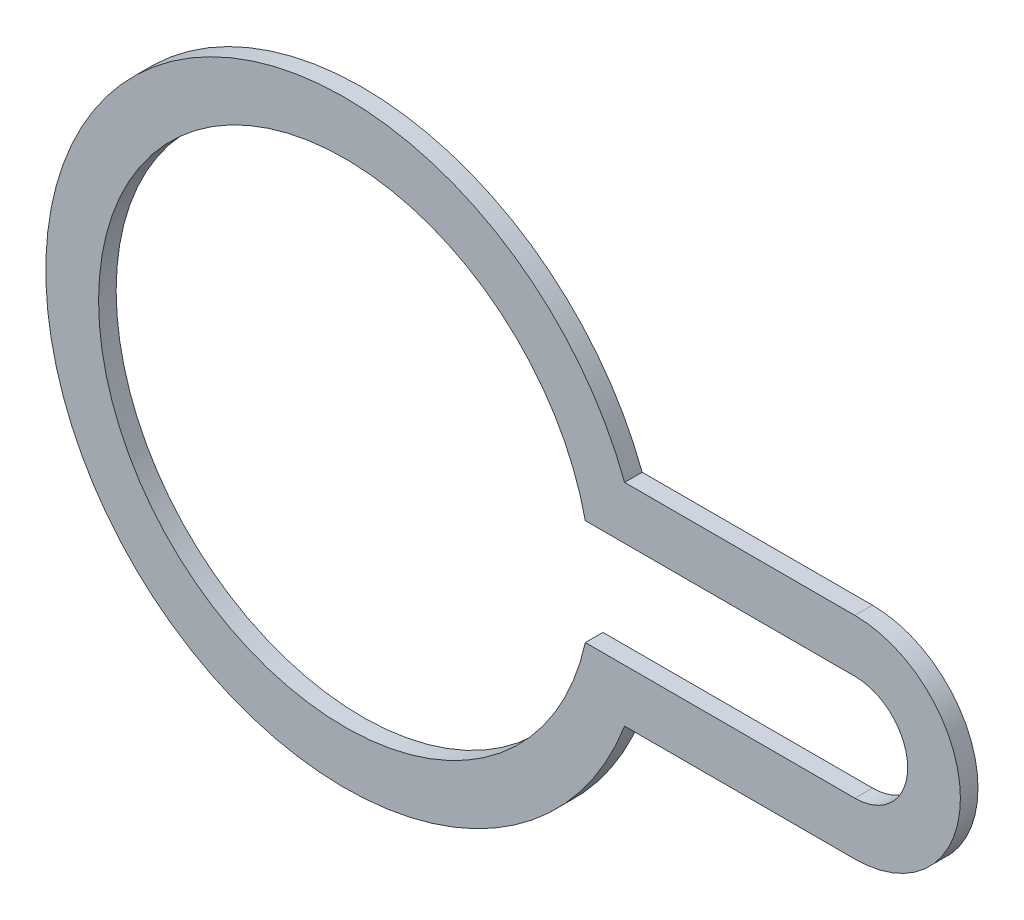
ISO-10303-21;
HEADER;
FILE_DESCRIPTION(('STEP AP214'),'2;1');
FILE_NAME('part.step','',(''),(''),'','','');
FILE_SCHEMA(('AUTOMOTIVE_DESIGN { 1 0 10303 214 1 1 1 1 }'));
ENDSEC;
DATA;
#1=APPLICATION_CONTEXT('core data for automotive mechanical design processes');
#2=APPLICATION_PROTOCOL_DEFINITION('international standard','automotive_design',2000,#1);
#3=PRODUCT_CONTEXT('',#1,'mechanical');
#4=PRODUCT('Part','Part','',(#3));
#5=PRODUCT_RELATED_PRODUCT_CATEGORY('part','',(#4));
#6=PRODUCT_DEFINITION_FORMATION('','',#4);
#7=PRODUCT_DEFINITION_CONTEXT('part definition',#1,'design');
#8=PRODUCT_DEFINITION('design','',#6,#7);
#9=PRODUCT_DEFINITION_SHAPE('','',#8);
#10=(LENGTH_UNIT() NAMED_UNIT(*) SI_UNIT(.MILLI.,.METRE.));
#11=(NAMED_UNIT(*) PLANE_ANGLE_UNIT() SI_UNIT($,.RADIAN.));
#12=(NAMED_UNIT(*) SI_UNIT($,.STERADIAN.) SOLID_ANGLE_UNIT());
#13=UNCERTAINTY_MEASURE_WITH_UNIT(LENGTH_MEASURE(1.E-05),#10,'distance_accuracy_value','');
#14=(GEOMETRIC_REPRESENTATION_CONTEXT(3) GLOBAL_UNCERTAINTY_ASSIGNED_CONTEXT((#13)) GLOBAL_UNIT_ASSIGNED_CONTEXT((#10,
#11,#12)) REPRESENTATION_CONTEXT('',''));
#15=CARTESIAN_POINT('',(0.,0.,0.));
#16=DIRECTION('',(0.,0.,1.));
#17=DIRECTION('',(1.,0.,0.));
#18=AXIS2_PLACEMENT_3D('',#15,#16,#17);
#19=CARTESIAN_POINT('',(0.,0.,1.));
#20=DIRECTION('',(0.,0.,-1.));
#21=DIRECTION('',(-1.,0.,0.));
#22=AXIS2_PLACEMENT_3D('',#19,#20,#21);
#23=PLANE('',#22);
#24=DIRECTION('',(-1.,0.,0.));
#25=VECTOR('',#24,1.);
#26=CARTESIAN_POINT('',(29.,-6.,1.));
#27=LINE('',#26,#25);
#28=CARTESIAN_POINT('',(29.,-6.,1.));
#29=VERTEX_POINT('',#28);
#30=CARTESIAN_POINT('',(15.9059737205869,-6.,1.));
#31=VERTEX_POINT('',#30);
#32=EDGE_CURVE('E177',#29,#31,#27,.T.);
#33=ORIENTED_EDGE('',*,*,#32,.F.);
#34=CARTESIAN_POINT('',(29.,0.,1.));
#35=DIRECTION('',(0.,0.,-1.));
#36=DIRECTION('',(-1.,0.,0.));
#37=AXIS2_PLACEMENT_3D('',#34,#35,#36);
#38=CIRCLE('',#37,6.);
#39=CARTESIAN_POINT('',(29.,6.,1.));
#40=VERTEX_POINT('',#39);
#41=EDGE_CURVE('E189',#40,#29,#38,.T.);
#42=ORIENTED_EDGE('',*,*,#41,.F.);
#43=DIRECTION('',(-1.,0.,0.));
#44=VECTOR('',#43,1.);
#45=CARTESIAN_POINT('',(29.,6.,1.));
#46=LINE('',#45,#44);
#47=CARTESIAN_POINT('',(15.9059737205869,6.,1.));
#48=VERTEX_POINT('',#47);
#49=EDGE_CURVE('E186',#40,#48,#46,.T.);
#50=ORIENTED_EDGE('',*,*,#49,.T.);
#51=CARTESIAN_POINT('',(0.,0.,1.));
#52=DIRECTION('',(0.,0.,-1.));
#53=DIRECTION('',(-1.,0.,0.));
#54=AXIS2_PLACEMENT_3D('',#51,#52,#53);
#55=CIRCLE('',#54,17.);
#56=EDGE_CURVE('E181',#31,#48,#55,.T.);
#57=ORIENTED_EDGE('',*,*,#56,.F.);
#58=EDGE_LOOP('',(#33,#42,#50,#57));
#59=FACE_BOUND('',#58,.T.);
#60=DIRECTION('',(1.,0.,0.));
#61=VECTOR('',#60,1.);
#62=CARTESIAN_POINT('',(13.6747943311773,-3.,1.));
#63=LINE('',#62,#61);
#64=CARTESIAN_POINT('',(13.6747943311773,-2.99999999999999,1.));
#65=VERTEX_POINT('',#64);
#66=CARTESIAN_POINT('',(29.,-3.,1.));
#67=VERTEX_POINT('',#66);
#68=EDGE_CURVE('E128',#65,#67,#63,.T.);
#69=ORIENTED_EDGE('',*,*,#68,.F.);
#70=CARTESIAN_POINT('',(0.,0.,1.));
#71=DIRECTION('',(0.,0.,-1.));
#72=DIRECTION('',(-1.,0.,0.));
#73=AXIS2_PLACEMENT_3D('',#70,#71,#72);
#74=CIRCLE('',#73,14.);
#75=CARTESIAN_POINT('',(13.6747943311773,2.99999999999999,1.));
#76=VERTEX_POINT('',#75);
#77=EDGE_CURVE('E154',#65,#76,#74,.T.);
#78=ORIENTED_EDGE('',*,*,#77,.T.);
#79=DIRECTION('',(1.,0.,0.));
#80=VECTOR('',#79,1.);
#81=CARTESIAN_POINT('',(13.6747943311773,3.,1.));
#82=LINE('',#81,#80);
#83=CARTESIAN_POINT('',(29.,3.,1.));
#84=VERTEX_POINT('',#83);
#85=EDGE_CURVE('E81',#76,#84,#82,.T.);
#86=ORIENTED_EDGE('',*,*,#85,.T.);
#87=CARTESIAN_POINT('',(29.,0.,1.));
#88=DIRECTION('',(0.,0.,-1.));
#89=DIRECTION('',(-1.,0.,0.));
#90=AXIS2_PLACEMENT_3D('',#87,#88,#89);
#91=CIRCLE('',#90,3.);
#92=EDGE_CURVE('E139',#84,#67,#91,.T.);
#93=ORIENTED_EDGE('',*,*,#92,.T.);
#94=EDGE_LOOP('',(#69,#78,#86,#93));
#95=FACE_BOUND('',#94,.T.);
#96=ADVANCED_FACE('F63',(#59,#95),#23,.F.);
#97=CARTESIAN_POINT('',(0.,0.,0.));
#98=DIRECTION('',(0.,0.,-1.));
#99=DIRECTION('',(-1.,0.,0.));
#100=AXIS2_PLACEMENT_3D('',#97,#98,#99);
#101=PLANE('',#100);
#102=DIRECTION('',(-1.,0.,0.));
#103=VECTOR('',#102,1.);
#104=CARTESIAN_POINT('',(29.,-6.,0.));
#105=LINE('',#104,#103);
#106=CARTESIAN_POINT('',(29.,-6.,0.));
#107=VERTEX_POINT('',#106);
#108=CARTESIAN_POINT('',(15.9059737205869,-6.,0.));
#109=VERTEX_POINT('',#108);
#110=EDGE_CURVE('E148',#107,#109,#105,.T.);
#111=ORIENTED_EDGE('',*,*,#110,.T.);
#112=CARTESIAN_POINT('',(0.,0.,0.));
#113=DIRECTION('',(0.,0.,-1.));
#114=DIRECTION('',(-1.,0.,0.));
#115=AXIS2_PLACEMENT_3D('',#112,#113,#114);
#116=CIRCLE('',#115,17.);
#117=CARTESIAN_POINT('',(15.9059737205869,6.,0.));
#118=VERTEX_POINT('',#117);
#119=EDGE_CURVE('E196',#109,#118,#116,.T.);
#120=ORIENTED_EDGE('',*,*,#119,.T.);
#121=DIRECTION('',(-1.,0.,0.));
#122=VECTOR('',#121,1.);
#123=CARTESIAN_POINT('',(29.,6.,0.));
#124=LINE('',#123,#122);
#125=CARTESIAN_POINT('',(29.,6.,0.));
#126=VERTEX_POINT('',#125);
#127=EDGE_CURVE('E200',#126,#118,#124,.T.);
#128=ORIENTED_EDGE('',*,*,#127,.F.);
#129=CARTESIAN_POINT('',(29.,0.,0.));
#130=DIRECTION('',(0.,0.,-1.));
#131=DIRECTION('',(-1.,0.,0.));
#132=AXIS2_PLACEMENT_3D('',#129,#130,#131);
#133=CIRCLE('',#132,6.);
#134=EDGE_CURVE('E182',#126,#107,#133,.T.);
#135=ORIENTED_EDGE('',*,*,#134,.T.);
#136=EDGE_LOOP('',(#111,#120,#128,#135));
#137=FACE_BOUND('',#136,.T.);
#138=CARTESIAN_POINT('',(0.,0.,0.));
#139=DIRECTION('',(0.,0.,-1.));
#140=DIRECTION('',(-1.,0.,0.));
#141=AXIS2_PLACEMENT_3D('',#138,#139,#140);
#142=CIRCLE('',#141,14.);
#143=CARTESIAN_POINT('',(13.6747943311773,-2.99999999999999,0.));
#144=VERTEX_POINT('',#143);
#145=CARTESIAN_POINT('',(13.6747943311773,2.99999999999999,0.));
#146=VERTEX_POINT('',#145);
#147=EDGE_CURVE('E140',#144,#146,#142,.T.);
#148=ORIENTED_EDGE('',*,*,#147,.F.);
#149=DIRECTION('',(1.,0.,0.));
#150=VECTOR('',#149,1.);
#151=CARTESIAN_POINT('',(13.6747943311773,-3.,0.));
#152=LINE('',#151,#150);
#153=CARTESIAN_POINT('',(29.,-3.,0.));
#154=VERTEX_POINT('',#153);
#155=EDGE_CURVE('E89',#144,#154,#152,.T.);
#156=ORIENTED_EDGE('',*,*,#155,.T.);
#157=CARTESIAN_POINT('',(29.,0.,0.));
#158=DIRECTION('',(0.,0.,-1.));
#159=DIRECTION('',(-1.,0.,0.));
#160=AXIS2_PLACEMENT_3D('',#157,#158,#159);
#161=CIRCLE('',#160,3.);
#162=CARTESIAN_POINT('',(29.,3.,0.));
#163=VERTEX_POINT('',#162);
#164=EDGE_CURVE('E146',#163,#154,#161,.T.);
#165=ORIENTED_EDGE('',*,*,#164,.F.);
#166=DIRECTION('',(1.,0.,0.));
#167=VECTOR('',#166,1.);
#168=CARTESIAN_POINT('',(13.6747943311773,3.,0.));
#169=LINE('',#168,#167);
#170=EDGE_CURVE('E163',#146,#163,#169,.T.);
#171=ORIENTED_EDGE('',*,*,#170,.F.);
#172=EDGE_LOOP('',(#148,#156,#165,#171));
#173=FACE_BOUND('',#172,.T.);
#174=ADVANCED_FACE('F221',(#137,#173),#101,.T.);
#175=CARTESIAN_POINT('',(29.,-6.,1.));
#176=DIRECTION('',(0.,-1.,0.));
#177=DIRECTION('',(1.,0.,0.));
#178=AXIS2_PLACEMENT_3D('',#175,#176,#177);
#179=PLANE('',#178);
#180=ORIENTED_EDGE('',*,*,#110,.F.);
#181=DIRECTION('',(0.,0.,-1.));
#182=VECTOR('',#181,1.);
#183=CARTESIAN_POINT('',(29.,-6.,1.));
#184=LINE('',#183,#182);
#185=EDGE_CURVE('E12',#29,#107,#184,.T.);
#186=ORIENTED_EDGE('',*,*,#185,.F.);
#187=ORIENTED_EDGE('',*,*,#32,.T.);
#188=DIRECTION('',(0.,0.,-1.));
#189=VECTOR('',#188,1.);
#190=CARTESIAN_POINT('',(15.9059737205869,-6.,1.));
#191=LINE('',#190,#189);
#192=EDGE_CURVE('E67',#31,#109,#191,.T.);
#193=ORIENTED_EDGE('',*,*,#192,.T.);
#194=EDGE_LOOP('',(#180,#186,#187,#193));
#195=FACE_BOUND('',#194,.T.);
#196=ADVANCED_FACE('F65',(#195),#179,.T.);
#197=CARTESIAN_POINT('',(29.,0.,1.));
#198=DIRECTION('',(0.,0.,-1.));
#199=DIRECTION('',(-1.,0.,0.));
#200=AXIS2_PLACEMENT_3D('',#197,#198,#199);
#201=CYLINDRICAL_SURFACE('',#200,6.);
#202=ORIENTED_EDGE('',*,*,#134,.F.);
#203=DIRECTION('',(0.,0.,-1.));
#204=VECTOR('',#203,1.);
#205=CARTESIAN_POINT('',(29.,6.,1.));
#206=LINE('',#205,#204);
#207=EDGE_CURVE('E73',#40,#126,#206,.T.);
#208=ORIENTED_EDGE('',*,*,#207,.F.);
#209=ORIENTED_EDGE('',*,*,#41,.T.);
#210=ORIENTED_EDGE('',*,*,#185,.T.);
#211=EDGE_LOOP('',(#202,#208,#209,#210));
#212=FACE_BOUND('',#211,.T.);
#213=ADVANCED_FACE('F225',(#212),#201,.T.);
#214=CARTESIAN_POINT('',(29.,6.,1.));
#215=DIRECTION('',(0.,-1.,0.));
#216=DIRECTION('',(1.,0.,0.));
#217=AXIS2_PLACEMENT_3D('',#214,#215,#216);
#218=PLANE('',#217);
#219=ORIENTED_EDGE('',*,*,#127,.T.);
#220=DIRECTION('',(0.,0.,-1.));
#221=VECTOR('',#220,1.);
#222=CARTESIAN_POINT('',(15.9059737205869,6.,1.));
#223=LINE('',#222,#221);
#224=EDGE_CURVE('E208',#48,#118,#223,.T.);
#225=ORIENTED_EDGE('',*,*,#224,.F.);
#226=ORIENTED_EDGE('',*,*,#49,.F.);
#227=ORIENTED_EDGE('',*,*,#207,.T.);
#228=EDGE_LOOP('',(#219,#225,#226,#227));
#229=FACE_BOUND('',#228,.T.);
#230=ADVANCED_FACE('F230',(#229),#218,.F.);
#231=CARTESIAN_POINT('',(0.,0.,1.));
#232=DIRECTION('',(0.,0.,-1.));
#233=DIRECTION('',(-1.,0.,0.));
#234=AXIS2_PLACEMENT_3D('',#231,#232,#233);
#235=CYLINDRICAL_SURFACE('',#234,17.);
#236=ORIENTED_EDGE('',*,*,#119,.F.);
#237=ORIENTED_EDGE('',*,*,#192,.F.);
#238=ORIENTED_EDGE('',*,*,#56,.T.);
#239=ORIENTED_EDGE('',*,*,#224,.T.);
#240=EDGE_LOOP('',(#236,#237,#238,#239));
#241=FACE_BOUND('',#240,.T.);
#242=ADVANCED_FACE('F218',(#241),#235,.T.);
#243=CARTESIAN_POINT('',(13.6747943311773,-3.,1.));
#244=DIRECTION('',(0.,1.,0.));
#245=DIRECTION('',(0.,0.,1.));
#246=AXIS2_PLACEMENT_3D('',#243,#244,#245);
#247=PLANE('',#246);
#248=ORIENTED_EDGE('',*,*,#155,.F.);
#249=DIRECTION('',(0.,0.,-1.));
#250=VECTOR('',#249,1.);
#251=CARTESIAN_POINT('',(13.6747943311773,-2.99999999999999,1.));
#252=LINE('',#251,#250);
#253=EDGE_CURVE('E133',#65,#144,#252,.T.);
#254=ORIENTED_EDGE('',*,*,#253,.F.);
#255=ORIENTED_EDGE('',*,*,#68,.T.);
#256=DIRECTION('',(0.,0.,-1.));
#257=VECTOR('',#256,1.);
#258=CARTESIAN_POINT('',(29.,-3.,1.));
#259=LINE('',#258,#257);
#260=EDGE_CURVE('E131',#67,#154,#259,.T.);
#261=ORIENTED_EDGE('',*,*,#260,.T.);
#262=EDGE_LOOP('',(#248,#254,#255,#261));
#263=FACE_BOUND('',#262,.T.);
#264=ADVANCED_FACE('F130',(#263),#247,.T.);
#265=CARTESIAN_POINT('',(29.,0.,1.));
#266=DIRECTION('',(0.,0.,-1.));
#267=DIRECTION('',(-1.,0.,0.));
#268=AXIS2_PLACEMENT_3D('',#265,#266,#267);
#269=CYLINDRICAL_SURFACE('',#268,3.);
#270=ORIENTED_EDGE('',*,*,#164,.T.);
#271=ORIENTED_EDGE('',*,*,#260,.F.);
#272=ORIENTED_EDGE('',*,*,#92,.F.);
#273=DIRECTION('',(0.,0.,-1.));
#274=VECTOR('',#273,1.);
#275=CARTESIAN_POINT('',(29.,3.,1.));
#276=LINE('',#275,#274);
#277=EDGE_CURVE('E149',#84,#163,#276,.T.);
#278=ORIENTED_EDGE('',*,*,#277,.T.);
#279=EDGE_LOOP('',(#270,#271,#272,#278));
#280=FACE_BOUND('',#279,.T.);
#281=ADVANCED_FACE('F144',(#280),#269,.F.);
#282=CARTESIAN_POINT('',(13.6747943311773,3.,1.));
#283=DIRECTION('',(0.,1.,0.));
#284=DIRECTION('',(0.,0.,1.));
#285=AXIS2_PLACEMENT_3D('',#282,#283,#284);
#286=PLANE('',#285);
#287=ORIENTED_EDGE('',*,*,#170,.T.);
#288=ORIENTED_EDGE('',*,*,#277,.F.);
#289=ORIENTED_EDGE('',*,*,#85,.F.);
#290=DIRECTION('',(0.,0.,-1.));
#291=VECTOR('',#290,1.);
#292=CARTESIAN_POINT('',(13.6747943311773,2.99999999999999,1.));
#293=LINE('',#292,#291);
#294=EDGE_CURVE('E172',#76,#146,#293,.T.);
#295=ORIENTED_EDGE('',*,*,#294,.T.);
#296=EDGE_LOOP('',(#287,#288,#289,#295));
#297=FACE_BOUND('',#296,.T.);
#298=ADVANCED_FACE('F249',(#297),#286,.F.);
#299=CARTESIAN_POINT('',(0.,0.,1.));
#300=DIRECTION('',(0.,0.,-1.));
#301=DIRECTION('',(-1.,0.,0.));
#302=AXIS2_PLACEMENT_3D('',#299,#300,#301);
#303=CYLINDRICAL_SURFACE('',#302,14.);
#304=ORIENTED_EDGE('',*,*,#147,.T.);
#305=ORIENTED_EDGE('',*,*,#294,.F.);
#306=ORIENTED_EDGE('',*,*,#77,.F.);
#307=ORIENTED_EDGE('',*,*,#253,.T.);
#308=EDGE_LOOP('',(#304,#305,#306,#307));
#309=FACE_BOUND('',#308,.T.);
#310=ADVANCED_FACE('F252',(#309),#303,.F.);
#311=CLOSED_SHELL('',(#96,#174,#196,#213,#230,#242,#264,#281,#298,#310));
#312=MANIFOLD_SOLID_BREP('B2',#311);
#313=ADVANCED_BREP_SHAPE_REPRESENTATION('',(#18,#312),#14);
#314=SHAPE_DEFINITION_REPRESENTATION(#9,#313);
ENDSEC;
END-ISO-10303-21;
